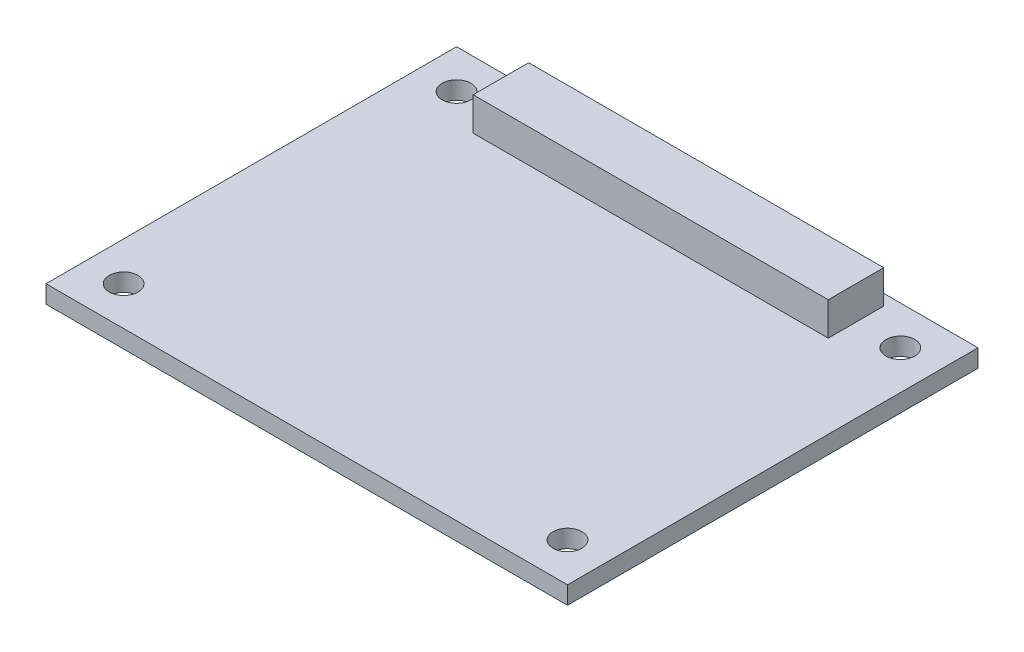
ISO-10303-21;
HEADER;
FILE_DESCRIPTION(('STEP AP214'),'2;1');
FILE_NAME('part.step','',(''),(''),'','','');
FILE_SCHEMA(('AUTOMOTIVE_DESIGN { 1 0 10303 214 1 1 1 1 }'));
ENDSEC;
DATA;
#1=APPLICATION_CONTEXT('core data for automotive mechanical design processes');
#2=APPLICATION_PROTOCOL_DEFINITION('international standard','automotive_design',2000,#1);
#3=PRODUCT_CONTEXT('',#1,'mechanical');
#4=PRODUCT('Part','Part','',(#3));
#5=PRODUCT_RELATED_PRODUCT_CATEGORY('part','',(#4));
#6=PRODUCT_DEFINITION_FORMATION('','',#4);
#7=PRODUCT_DEFINITION_CONTEXT('part definition',#1,'design');
#8=PRODUCT_DEFINITION('design','',#6,#7);
#9=PRODUCT_DEFINITION_SHAPE('','',#8);
#10=(LENGTH_UNIT() NAMED_UNIT(*) SI_UNIT(.MILLI.,.METRE.));
#11=(NAMED_UNIT(*) PLANE_ANGLE_UNIT() SI_UNIT($,.RADIAN.));
#12=(NAMED_UNIT(*) SI_UNIT($,.STERADIAN.) SOLID_ANGLE_UNIT());
#13=UNCERTAINTY_MEASURE_WITH_UNIT(LENGTH_MEASURE(1.E-05),#10,'distance_accuracy_value','');
#14=(GEOMETRIC_REPRESENTATION_CONTEXT(3) GLOBAL_UNCERTAINTY_ASSIGNED_CONTEXT((#13)) GLOBAL_UNIT_ASSIGNED_CONTEXT((#10,
#11,#12)) REPRESENTATION_CONTEXT('',''));
#15=CARTESIAN_POINT('',(0.,0.,0.));
#16=DIRECTION('',(0.,0.,1.));
#17=DIRECTION('',(1.,0.,0.));
#18=AXIS2_PLACEMENT_3D('',#15,#16,#17);
#19=CARTESIAN_POINT('',(0.,0.,0.));
#20=DIRECTION('',(0.,1.,0.));
#21=DIRECTION('',(0.,0.,1.));
#22=AXIS2_PLACEMENT_3D('',#19,#20,#21);
#23=PLANE('',#22);
#24=CARTESIAN_POINT('',(20.,0.,-15.));
#25=DIRECTION('',(0.,1.,0.));
#26=DIRECTION('',(0.,0.,1.));
#27=AXIS2_PLACEMENT_3D('',#24,#25,#26);
#28=CIRCLE('',#27,1.3);
#29=CARTESIAN_POINT('',(20.,0.,-13.7));
#30=VERTEX_POINT('',#29);
#31=EDGE_CURVE('E130',#30,#30,#28,.T.);
#32=ORIENTED_EDGE('',*,*,#31,.F.);
#33=EDGE_LOOP('',(#32));
#34=FACE_BOUND('',#33,.T.);
#35=CARTESIAN_POINT('',(20.,0.,15.));
#36=DIRECTION('',(0.,1.,0.));
#37=DIRECTION('',(0.,0.,1.));
#38=AXIS2_PLACEMENT_3D('',#35,#36,#37);
#39=CIRCLE('',#38,1.3);
#40=CARTESIAN_POINT('',(20.,0.,16.3));
#41=VERTEX_POINT('',#40);
#42=EDGE_CURVE('E148',#41,#41,#39,.T.);
#43=ORIENTED_EDGE('',*,*,#42,.F.);
#44=EDGE_LOOP('',(#43));
#45=FACE_BOUND('',#44,.T.);
#46=CARTESIAN_POINT('',(-20.,0.,15.));
#47=DIRECTION('',(0.,1.,0.));
#48=DIRECTION('',(0.,0.,1.));
#49=AXIS2_PLACEMENT_3D('',#46,#47,#48);
#50=CIRCLE('',#49,1.3);
#51=CARTESIAN_POINT('',(-20.,0.,16.3));
#52=VERTEX_POINT('',#51);
#53=EDGE_CURVE('E142',#52,#52,#50,.T.);
#54=ORIENTED_EDGE('',*,*,#53,.F.);
#55=EDGE_LOOP('',(#54));
#56=FACE_BOUND('',#55,.T.);
#57=CARTESIAN_POINT('',(-20.,0.,-15.));
#58=DIRECTION('',(0.,1.,0.));
#59=DIRECTION('',(0.,0.,1.));
#60=AXIS2_PLACEMENT_3D('',#57,#58,#59);
#61=CIRCLE('',#60,1.3);
#62=CARTESIAN_POINT('',(-20.,0.,-13.7));
#63=VERTEX_POINT('',#62);
#64=EDGE_CURVE('E141',#63,#63,#61,.T.);
#65=ORIENTED_EDGE('',*,*,#64,.F.);
#66=EDGE_LOOP('',(#65));
#67=FACE_BOUND('',#66,.T.);
#68=DIRECTION('',(0.,0.,1.));
#69=VECTOR('',#68,1.);
#70=CARTESIAN_POINT('',(-23.5,0.,18.5));
#71=LINE('',#70,#69);
#72=CARTESIAN_POINT('',(-23.5,0.,-18.5));
#73=VERTEX_POINT('',#72);
#74=CARTESIAN_POINT('',(-23.5,0.,18.5));
#75=VERTEX_POINT('',#74);
#76=EDGE_CURVE('E156',#73,#75,#71,.T.);
#77=ORIENTED_EDGE('',*,*,#76,.T.);
#78=DIRECTION('',(1.,0.,0.));
#79=VECTOR('',#78,1.);
#80=CARTESIAN_POINT('',(23.5,0.,18.5));
#81=LINE('',#80,#79);
#82=CARTESIAN_POINT('',(23.5,0.,18.5));
#83=VERTEX_POINT('',#82);
#84=EDGE_CURVE('E171',#75,#83,#81,.T.);
#85=ORIENTED_EDGE('',*,*,#84,.T.);
#86=DIRECTION('',(0.,0.,-1.));
#87=VECTOR('',#86,1.);
#88=CARTESIAN_POINT('',(23.5,0.,18.5));
#89=LINE('',#88,#87);
#90=CARTESIAN_POINT('',(23.5,0.,-18.5));
#91=VERTEX_POINT('',#90);
#92=EDGE_CURVE('E174',#83,#91,#89,.T.);
#93=ORIENTED_EDGE('',*,*,#92,.T.);
#94=DIRECTION('',(-1.,0.,0.));
#95=VECTOR('',#94,1.);
#96=CARTESIAN_POINT('',(23.5,0.,-18.5));
#97=LINE('',#96,#95);
#98=EDGE_CURVE('E162',#91,#73,#97,.T.);
#99=ORIENTED_EDGE('',*,*,#98,.T.);
#100=EDGE_LOOP('',(#77,#85,#93,#99));
#101=FACE_BOUND('',#100,.T.);
#102=DIRECTION('',(1.,0.,0.));
#103=VECTOR('',#102,1.);
#104=CARTESIAN_POINT('',(16.,0.,-12.5));
#105=LINE('',#104,#103);
#106=CARTESIAN_POINT('',(-16.,0.,-12.5));
#107=VERTEX_POINT('',#106);
#108=CARTESIAN_POINT('',(16.,0.,-12.5));
#109=VERTEX_POINT('',#108);
#110=EDGE_CURVE('E319',#107,#109,#105,.T.);
#111=ORIENTED_EDGE('',*,*,#110,.F.);
#112=DIRECTION('',(0.,0.,1.));
#113=VECTOR('',#112,1.);
#114=CARTESIAN_POINT('',(-16.,0.,-12.5));
#115=LINE('',#114,#113);
#116=CARTESIAN_POINT('',(-16.,0.,-17.5));
#117=VERTEX_POINT('',#116);
#118=EDGE_CURVE('E128',#117,#107,#115,.T.);
#119=ORIENTED_EDGE('',*,*,#118,.F.);
#120=DIRECTION('',(-1.,0.,0.));
#121=VECTOR('',#120,1.);
#122=CARTESIAN_POINT('',(16.,0.,-17.5));
#123=LINE('',#122,#121);
#124=CARTESIAN_POINT('',(16.,0.,-17.5));
#125=VERTEX_POINT('',#124);
#126=EDGE_CURVE('E124',#125,#117,#123,.T.);
#127=ORIENTED_EDGE('',*,*,#126,.F.);
#128=DIRECTION('',(0.,0.,-1.));
#129=VECTOR('',#128,1.);
#130=CARTESIAN_POINT('',(16.,0.,-12.5));
#131=LINE('',#130,#129);
#132=EDGE_CURVE('E316',#109,#125,#131,.T.);
#133=ORIENTED_EDGE('',*,*,#132,.F.);
#134=EDGE_LOOP('',(#111,#119,#127,#133));
#135=FACE_BOUND('',#134,.T.);
#136=ADVANCED_FACE('F32',(#34,#45,#56,#67,#101,#135),#23,.T.);
#137=CARTESIAN_POINT('',(-23.5,-1.6,18.5));
#138=DIRECTION('',(-1.,0.,0.));
#139=DIRECTION('',(0.,0.,1.));
#140=AXIS2_PLACEMENT_3D('',#137,#138,#139);
#141=PLANE('',#140);
#142=ORIENTED_EDGE('',*,*,#76,.F.);
#143=DIRECTION('',(0.,1.,0.));
#144=VECTOR('',#143,1.);
#145=CARTESIAN_POINT('',(-23.5,-1.6,-18.5));
#146=LINE('',#145,#144);
#147=CARTESIAN_POINT('',(-23.5,-1.6,-18.5));
#148=VERTEX_POINT('',#147);
#149=EDGE_CURVE('E11',#148,#73,#146,.T.);
#150=ORIENTED_EDGE('',*,*,#149,.F.);
#151=DIRECTION('',(0.,0.,1.));
#152=VECTOR('',#151,1.);
#153=CARTESIAN_POINT('',(-23.5,-1.6,18.5));
#154=LINE('',#153,#152);
#155=CARTESIAN_POINT('',(-23.5,-1.6,18.5));
#156=VERTEX_POINT('',#155);
#157=EDGE_CURVE('E159',#148,#156,#154,.T.);
#158=ORIENTED_EDGE('',*,*,#157,.T.);
#159=DIRECTION('',(0.,1.,0.));
#160=VECTOR('',#159,1.);
#161=CARTESIAN_POINT('',(-23.5,-1.6,18.5));
#162=LINE('',#161,#160);
#163=EDGE_CURVE('E36',#156,#75,#162,.T.);
#164=ORIENTED_EDGE('',*,*,#163,.T.);
#165=EDGE_LOOP('',(#142,#150,#158,#164));
#166=FACE_BOUND('',#165,.T.);
#167=ADVANCED_FACE('F34',(#166),#141,.T.);
#168=CARTESIAN_POINT('',(23.5,-1.6,-18.5));
#169=DIRECTION('',(0.,0.,-1.));
#170=DIRECTION('',(-1.,0.,0.));
#171=AXIS2_PLACEMENT_3D('',#168,#169,#170);
#172=PLANE('',#171);
#173=ORIENTED_EDGE('',*,*,#98,.F.);
#174=DIRECTION('',(0.,1.,0.));
#175=VECTOR('',#174,1.);
#176=CARTESIAN_POINT('',(23.5,-1.6,-18.5));
#177=LINE('',#176,#175);
#178=CARTESIAN_POINT('',(23.5,-1.6,-18.5));
#179=VERTEX_POINT('',#178);
#180=EDGE_CURVE('E41',#179,#91,#177,.T.);
#181=ORIENTED_EDGE('',*,*,#180,.F.);
#182=DIRECTION('',(-1.,0.,0.));
#183=VECTOR('',#182,1.);
#184=CARTESIAN_POINT('',(23.5,-1.6,-18.5));
#185=LINE('',#184,#183);
#186=EDGE_CURVE('E167',#179,#148,#185,.T.);
#187=ORIENTED_EDGE('',*,*,#186,.T.);
#188=ORIENTED_EDGE('',*,*,#149,.T.);
#189=EDGE_LOOP('',(#173,#181,#187,#188));
#190=FACE_BOUND('',#189,.T.);
#191=ADVANCED_FACE('F184',(#190),#172,.T.);
#192=CARTESIAN_POINT('',(23.5,-1.6,18.5));
#193=DIRECTION('',(1.,0.,0.));
#194=DIRECTION('',(0.,0.,-1.));
#195=AXIS2_PLACEMENT_3D('',#192,#193,#194);
#196=PLANE('',#195);
#197=ORIENTED_EDGE('',*,*,#92,.F.);
#198=DIRECTION('',(0.,1.,0.));
#199=VECTOR('',#198,1.);
#200=CARTESIAN_POINT('',(23.5,-1.6,18.5));
#201=LINE('',#200,#199);
#202=CARTESIAN_POINT('',(23.5,-1.6,18.5));
#203=VERTEX_POINT('',#202);
#204=EDGE_CURVE('E179',#203,#83,#201,.T.);
#205=ORIENTED_EDGE('',*,*,#204,.F.);
#206=DIRECTION('',(0.,0.,-1.));
#207=VECTOR('',#206,1.);
#208=CARTESIAN_POINT('',(23.5,-1.6,18.5));
#209=LINE('',#208,#207);
#210=EDGE_CURVE('E164',#203,#179,#209,.T.);
#211=ORIENTED_EDGE('',*,*,#210,.T.);
#212=ORIENTED_EDGE('',*,*,#180,.T.);
#213=EDGE_LOOP('',(#197,#205,#211,#212));
#214=FACE_BOUND('',#213,.T.);
#215=ADVANCED_FACE('F188',(#214),#196,.T.);
#216=CARTESIAN_POINT('',(23.5,-1.6,18.5));
#217=DIRECTION('',(0.,0.,1.));
#218=DIRECTION('',(1.,0.,0.));
#219=AXIS2_PLACEMENT_3D('',#216,#217,#218);
#220=PLANE('',#219);
#221=ORIENTED_EDGE('',*,*,#84,.F.);
#222=ORIENTED_EDGE('',*,*,#163,.F.);
#223=DIRECTION('',(1.,0.,0.));
#224=VECTOR('',#223,1.);
#225=CARTESIAN_POINT('',(23.5,-1.6,18.5));
#226=LINE('',#225,#224);
#227=EDGE_CURVE('E161',#156,#203,#226,.T.);
#228=ORIENTED_EDGE('',*,*,#227,.T.);
#229=ORIENTED_EDGE('',*,*,#204,.T.);
#230=EDGE_LOOP('',(#221,#222,#228,#229));
#231=FACE_BOUND('',#230,.T.);
#232=ADVANCED_FACE('F181',(#231),#220,.T.);
#233=CARTESIAN_POINT('',(0.,-1.6,0.));
#234=DIRECTION('',(0.,1.,0.));
#235=DIRECTION('',(0.,0.,1.));
#236=AXIS2_PLACEMENT_3D('',#233,#234,#235);
#237=PLANE('',#236);
#238=CARTESIAN_POINT('',(20.,-1.6,-15.));
#239=DIRECTION('',(0.,1.,0.));
#240=DIRECTION('',(0.,0.,1.));
#241=AXIS2_PLACEMENT_3D('',#238,#239,#240);
#242=CIRCLE('',#241,1.3);
#243=CARTESIAN_POINT('',(20.,-1.6,-13.7));
#244=VERTEX_POINT('',#243);
#245=EDGE_CURVE('E133',#244,#244,#242,.T.);
#246=ORIENTED_EDGE('',*,*,#245,.T.);
#247=EDGE_LOOP('',(#246));
#248=FACE_BOUND('',#247,.T.);
#249=CARTESIAN_POINT('',(20.,-1.6,15.));
#250=DIRECTION('',(0.,1.,0.));
#251=DIRECTION('',(0.,0.,1.));
#252=AXIS2_PLACEMENT_3D('',#249,#250,#251);
#253=CIRCLE('',#252,1.3);
#254=CARTESIAN_POINT('',(20.,-1.6,16.3));
#255=VERTEX_POINT('',#254);
#256=EDGE_CURVE('E145',#255,#255,#253,.T.);
#257=ORIENTED_EDGE('',*,*,#256,.T.);
#258=EDGE_LOOP('',(#257));
#259=FACE_BOUND('',#258,.T.);
#260=CARTESIAN_POINT('',(-20.,-1.6,15.));
#261=DIRECTION('',(0.,1.,0.));
#262=DIRECTION('',(0.,0.,1.));
#263=AXIS2_PLACEMENT_3D('',#260,#261,#262);
#264=CIRCLE('',#263,1.3);
#265=CARTESIAN_POINT('',(-20.,-1.6,16.3));
#266=VERTEX_POINT('',#265);
#267=EDGE_CURVE('E138',#266,#266,#264,.T.);
#268=ORIENTED_EDGE('',*,*,#267,.T.);
#269=EDGE_LOOP('',(#268));
#270=FACE_BOUND('',#269,.T.);
#271=CARTESIAN_POINT('',(-20.,-1.6,-15.));
#272=DIRECTION('',(0.,1.,0.));
#273=DIRECTION('',(0.,0.,1.));
#274=AXIS2_PLACEMENT_3D('',#271,#272,#273);
#275=CIRCLE('',#274,1.3);
#276=CARTESIAN_POINT('',(-20.,-1.6,-13.7));
#277=VERTEX_POINT('',#276);
#278=EDGE_CURVE('E153',#277,#277,#275,.T.);
#279=ORIENTED_EDGE('',*,*,#278,.T.);
#280=EDGE_LOOP('',(#279));
#281=FACE_BOUND('',#280,.T.);
#282=ORIENTED_EDGE('',*,*,#157,.F.);
#283=ORIENTED_EDGE('',*,*,#186,.F.);
#284=ORIENTED_EDGE('',*,*,#210,.F.);
#285=ORIENTED_EDGE('',*,*,#227,.F.);
#286=EDGE_LOOP('',(#282,#283,#284,#285));
#287=FACE_BOUND('',#286,.T.);
#288=ADVANCED_FACE('F190',(#248,#259,#270,#281,#287),#237,.F.);
#289=CARTESIAN_POINT('',(-20.,-1.6,-15.));
#290=DIRECTION('',(0.,1.,0.));
#291=DIRECTION('',(0.,0.,1.));
#292=AXIS2_PLACEMENT_3D('',#289,#290,#291);
#293=CYLINDRICAL_SURFACE('',#292,1.3);
#294=ORIENTED_EDGE('',*,*,#278,.F.);
#295=EDGE_LOOP('',(#294));
#296=FACE_BOUND('',#295,.T.);
#297=ORIENTED_EDGE('',*,*,#64,.T.);
#298=EDGE_LOOP('',(#297));
#299=FACE_BOUND('',#298,.T.);
#300=ADVANCED_FACE('F192',(#296,#299),#293,.F.);
#301=CARTESIAN_POINT('',(-20.,-1.6,15.));
#302=DIRECTION('',(0.,1.,0.));
#303=DIRECTION('',(0.,0.,1.));
#304=AXIS2_PLACEMENT_3D('',#301,#302,#303);
#305=CYLINDRICAL_SURFACE('',#304,1.3);
#306=ORIENTED_EDGE('',*,*,#267,.F.);
#307=EDGE_LOOP('',(#306));
#308=FACE_BOUND('',#307,.T.);
#309=ORIENTED_EDGE('',*,*,#53,.T.);
#310=EDGE_LOOP('',(#309));
#311=FACE_BOUND('',#310,.T.);
#312=ADVANCED_FACE('F199',(#308,#311),#305,.F.);
#313=CARTESIAN_POINT('',(20.,-1.6,15.));
#314=DIRECTION('',(0.,1.,0.));
#315=DIRECTION('',(0.,0.,1.));
#316=AXIS2_PLACEMENT_3D('',#313,#314,#315);
#317=CYLINDRICAL_SURFACE('',#316,1.3);
#318=ORIENTED_EDGE('',*,*,#256,.F.);
#319=EDGE_LOOP('',(#318));
#320=FACE_BOUND('',#319,.T.);
#321=ORIENTED_EDGE('',*,*,#42,.T.);
#322=EDGE_LOOP('',(#321));
#323=FACE_BOUND('',#322,.T.);
#324=ADVANCED_FACE('F242',(#320,#323),#317,.F.);
#325=CARTESIAN_POINT('',(20.,-1.6,-15.));
#326=DIRECTION('',(0.,1.,0.));
#327=DIRECTION('',(0.,0.,1.));
#328=AXIS2_PLACEMENT_3D('',#325,#326,#327);
#329=CYLINDRICAL_SURFACE('',#328,1.3);
#330=ORIENTED_EDGE('',*,*,#245,.F.);
#331=EDGE_LOOP('',(#330));
#332=FACE_BOUND('',#331,.T.);
#333=ORIENTED_EDGE('',*,*,#31,.T.);
#334=EDGE_LOOP('',(#333));
#335=FACE_BOUND('',#334,.T.);
#336=ADVANCED_FACE('F252',(#332,#335),#329,.F.);
#337=CARTESIAN_POINT('',(-16.,3.,-12.5));
#338=DIRECTION('',(1.,0.,0.));
#339=DIRECTION('',(0.,0.,-1.));
#340=AXIS2_PLACEMENT_3D('',#337,#338,#339);
#341=PLANE('',#340);
#342=ORIENTED_EDGE('',*,*,#118,.T.);
#343=DIRECTION('',(0.,-1.,0.));
#344=VECTOR('',#343,1.);
#345=CARTESIAN_POINT('',(-16.,3.,-12.5));
#346=LINE('',#345,#344);
#347=CARTESIAN_POINT('',(-16.,3.,-12.5));
#348=VERTEX_POINT('',#347);
#349=EDGE_CURVE('E109',#348,#107,#346,.T.);
#350=ORIENTED_EDGE('',*,*,#349,.F.);
#351=DIRECTION('',(0.,0.,1.));
#352=VECTOR('',#351,1.);
#353=CARTESIAN_POINT('',(-16.,3.,-12.5));
#354=LINE('',#353,#352);
#355=CARTESIAN_POINT('',(-16.,3.,-17.5));
#356=VERTEX_POINT('',#355);
#357=EDGE_CURVE('E116',#356,#348,#354,.T.);
#358=ORIENTED_EDGE('',*,*,#357,.F.);
#359=DIRECTION('',(0.,-1.,0.));
#360=VECTOR('',#359,1.);
#361=CARTESIAN_POINT('',(-16.,3.,-17.5));
#362=LINE('',#361,#360);
#363=EDGE_CURVE('E314',#356,#117,#362,.T.);
#364=ORIENTED_EDGE('',*,*,#363,.T.);
#365=EDGE_LOOP('',(#342,#350,#358,#364));
#366=FACE_BOUND('',#365,.T.);
#367=ADVANCED_FACE('F126',(#366),#341,.F.);
#368=CARTESIAN_POINT('',(16.,3.,-12.5));
#369=DIRECTION('',(0.,0.,-1.));
#370=DIRECTION('',(-1.,0.,0.));
#371=AXIS2_PLACEMENT_3D('',#368,#369,#370);
#372=PLANE('',#371);
#373=ORIENTED_EDGE('',*,*,#110,.T.);
#374=DIRECTION('',(0.,-1.,0.));
#375=VECTOR('',#374,1.);
#376=CARTESIAN_POINT('',(16.,3.,-12.5));
#377=LINE('',#376,#375);
#378=CARTESIAN_POINT('',(16.,3.,-12.5));
#379=VERTEX_POINT('',#378);
#380=EDGE_CURVE('E112',#379,#109,#377,.T.);
#381=ORIENTED_EDGE('',*,*,#380,.F.);
#382=DIRECTION('',(1.,0.,0.));
#383=VECTOR('',#382,1.);
#384=CARTESIAN_POINT('',(16.,3.,-12.5));
#385=LINE('',#384,#383);
#386=EDGE_CURVE('E105',#348,#379,#385,.T.);
#387=ORIENTED_EDGE('',*,*,#386,.F.);
#388=ORIENTED_EDGE('',*,*,#349,.T.);
#389=EDGE_LOOP('',(#373,#381,#387,#388));
#390=FACE_BOUND('',#389,.T.);
#391=ADVANCED_FACE('F107',(#390),#372,.F.);
#392=CARTESIAN_POINT('',(16.,3.,-12.5));
#393=DIRECTION('',(-1.,0.,0.));
#394=DIRECTION('',(0.,0.,1.));
#395=AXIS2_PLACEMENT_3D('',#392,#393,#394);
#396=PLANE('',#395);
#397=ORIENTED_EDGE('',*,*,#132,.T.);
#398=DIRECTION('',(0.,-1.,0.));
#399=VECTOR('',#398,1.);
#400=CARTESIAN_POINT('',(16.,3.,-17.5));
#401=LINE('',#400,#399);
#402=CARTESIAN_POINT('',(16.,3.,-17.5));
#403=VERTEX_POINT('',#402);
#404=EDGE_CURVE('E49',#403,#125,#401,.T.);
#405=ORIENTED_EDGE('',*,*,#404,.F.);
#406=DIRECTION('',(0.,0.,-1.));
#407=VECTOR('',#406,1.);
#408=CARTESIAN_POINT('',(16.,3.,-12.5));
#409=LINE('',#408,#407);
#410=EDGE_CURVE('E115',#379,#403,#409,.T.);
#411=ORIENTED_EDGE('',*,*,#410,.F.);
#412=ORIENTED_EDGE('',*,*,#380,.T.);
#413=EDGE_LOOP('',(#397,#405,#411,#412));
#414=FACE_BOUND('',#413,.T.);
#415=ADVANCED_FACE('F283',(#414),#396,.F.);
#416=CARTESIAN_POINT('',(16.,3.,-17.5));
#417=DIRECTION('',(0.,0.,1.));
#418=DIRECTION('',(1.,0.,0.));
#419=AXIS2_PLACEMENT_3D('',#416,#417,#418);
#420=PLANE('',#419);
#421=ORIENTED_EDGE('',*,*,#126,.T.);
#422=ORIENTED_EDGE('',*,*,#363,.F.);
#423=DIRECTION('',(-1.,0.,0.));
#424=VECTOR('',#423,1.);
#425=CARTESIAN_POINT('',(16.,3.,-17.5));
#426=LINE('',#425,#424);
#427=EDGE_CURVE('E120',#403,#356,#426,.T.);
#428=ORIENTED_EDGE('',*,*,#427,.F.);
#429=ORIENTED_EDGE('',*,*,#404,.T.);
#430=EDGE_LOOP('',(#421,#422,#428,#429));
#431=FACE_BOUND('',#430,.T.);
#432=ADVANCED_FACE('F292',(#431),#420,.F.);
#433=CARTESIAN_POINT('',(0.,3.,0.));
#434=DIRECTION('',(0.,1.,0.));
#435=DIRECTION('',(0.,0.,1.));
#436=AXIS2_PLACEMENT_3D('',#433,#434,#435);
#437=PLANE('',#436);
#438=ORIENTED_EDGE('',*,*,#357,.T.);
#439=ORIENTED_EDGE('',*,*,#386,.T.);
#440=ORIENTED_EDGE('',*,*,#410,.T.);
#441=ORIENTED_EDGE('',*,*,#427,.T.);
#442=EDGE_LOOP('',(#438,#439,#440,#441));
#443=FACE_BOUND('',#442,.T.);
#444=ADVANCED_FACE('F119',(#443),#437,.T.);
#445=CLOSED_SHELL('',(#136,#167,#191,#215,#232,#288,#300,#312,#324,#336,#367,#391,#415,#432,#444));
#446=MANIFOLD_SOLID_BREP('B2',#445);
#447=ADVANCED_BREP_SHAPE_REPRESENTATION('',(#18,#446),#14);
#448=SHAPE_DEFINITION_REPRESENTATION(#9,#447);
ENDSEC;
END-ISO-10303-21;
